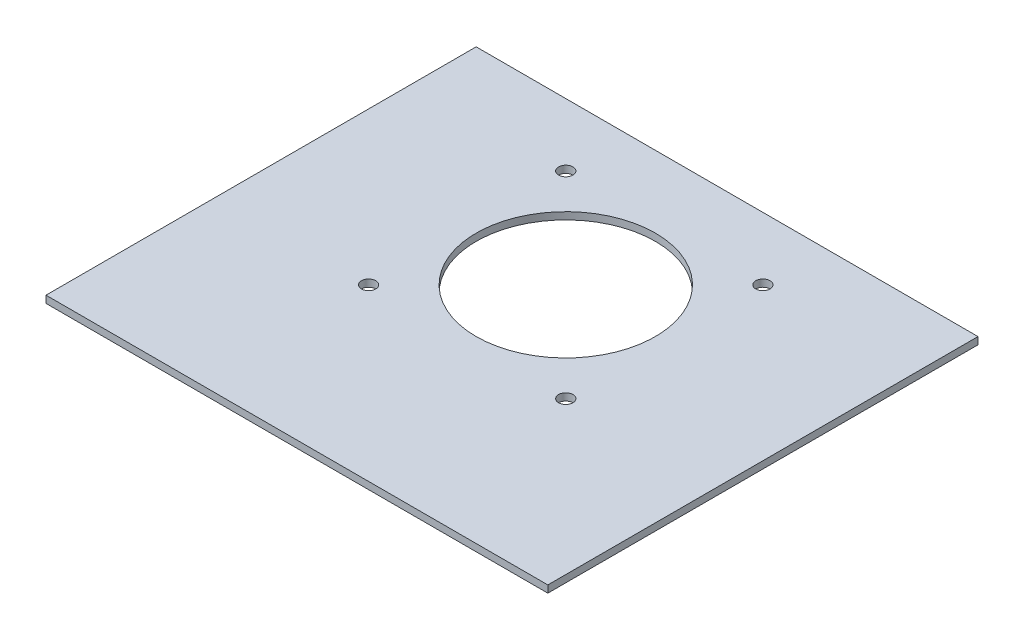
ISO-10303-21;
HEADER;
FILE_DESCRIPTION(('STEP AP214'),'2;1');
FILE_NAME('part.step','',(''),(''),'','','');
FILE_SCHEMA(('AUTOMOTIVE_DESIGN { 1 0 10303 214 1 1 1 1 }'));
ENDSEC;
DATA;
#1=APPLICATION_CONTEXT('core data for automotive mechanical design processes');
#2=APPLICATION_PROTOCOL_DEFINITION('international standard','automotive_design',2000,#1);
#3=PRODUCT_CONTEXT('',#1,'mechanical');
#4=PRODUCT('Part','Part','',(#3));
#5=PRODUCT_RELATED_PRODUCT_CATEGORY('part','',(#4));
#6=PRODUCT_DEFINITION_FORMATION('','',#4);
#7=PRODUCT_DEFINITION_CONTEXT('part definition',#1,'design');
#8=PRODUCT_DEFINITION('design','',#6,#7);
#9=PRODUCT_DEFINITION_SHAPE('','',#8);
#10=(LENGTH_UNIT() NAMED_UNIT(*) SI_UNIT(.MILLI.,.METRE.));
#11=(NAMED_UNIT(*) PLANE_ANGLE_UNIT() SI_UNIT($,.RADIAN.));
#12=(NAMED_UNIT(*) SI_UNIT($,.STERADIAN.) SOLID_ANGLE_UNIT());
#13=UNCERTAINTY_MEASURE_WITH_UNIT(LENGTH_MEASURE(1.E-05),#10,'distance_accuracy_value','');
#14=(GEOMETRIC_REPRESENTATION_CONTEXT(3) GLOBAL_UNCERTAINTY_ASSIGNED_CONTEXT((#13)) GLOBAL_UNIT_ASSIGNED_CONTEXT((#10,
#11,#12)) REPRESENTATION_CONTEXT('',''));
#15=CARTESIAN_POINT('',(0.,0.,0.));
#16=DIRECTION('',(0.,0.,1.));
#17=DIRECTION('',(1.,0.,0.));
#18=AXIS2_PLACEMENT_3D('',#15,#16,#17);
#19=CARTESIAN_POINT('',(0.,2.,0.));
#20=DIRECTION('',(0.,1.,0.));
#21=DIRECTION('',(0.,0.,1.));
#22=AXIS2_PLACEMENT_3D('',#19,#20,#21);
#23=PLANE('',#22);
#24=CARTESIAN_POINT('',(-27.4999999999994,2.,27.5000000000004));
#25=DIRECTION('',(0.,1.,0.));
#26=DIRECTION('',(0.,0.,1.));
#27=AXIS2_PLACEMENT_3D('',#24,#25,#26);
#28=CIRCLE('',#27,2.);
#29=CARTESIAN_POINT('',(-27.4999999999994,2.,29.5000000000004));
#30=VERTEX_POINT('',#29);
#31=EDGE_CURVE('E128',#30,#30,#28,.T.);
#32=ORIENTED_EDGE('',*,*,#31,.F.);
#33=EDGE_LOOP('',(#32));
#34=FACE_BOUND('',#33,.T.);
#35=CARTESIAN_POINT('',(0.,2.,0.));
#36=DIRECTION('',(0.,1.,0.));
#37=DIRECTION('',(0.,0.,1.));
#38=AXIS2_PLACEMENT_3D('',#35,#36,#37);
#39=CIRCLE('',#38,25.);
#40=CARTESIAN_POINT('',(0.,2.,25.));
#41=VERTEX_POINT('',#40);
#42=EDGE_CURVE('E116',#41,#41,#39,.T.);
#43=ORIENTED_EDGE('',*,*,#42,.F.);
#44=EDGE_LOOP('',(#43));
#45=FACE_BOUND('',#44,.T.);
#46=DIRECTION('',(0.,0.,1.));
#47=VECTOR('',#46,1.);
#48=CARTESIAN_POINT('',(-70.,2.,-45.));
#49=LINE('',#48,#47);
#50=CARTESIAN_POINT('',(-70.,2.,-45.));
#51=VERTEX_POINT('',#50);
#52=CARTESIAN_POINT('',(-70.,2.,75.));
#53=VERTEX_POINT('',#52);
#54=EDGE_CURVE('E86',#51,#53,#49,.T.);
#55=ORIENTED_EDGE('',*,*,#54,.T.);
#56=DIRECTION('',(1.,0.,0.));
#57=VECTOR('',#56,1.);
#58=CARTESIAN_POINT('',(-70.,2.,75.));
#59=LINE('',#58,#57);
#60=CARTESIAN_POINT('',(70.,2.,75.));
#61=VERTEX_POINT('',#60);
#62=EDGE_CURVE('E81',#53,#61,#59,.T.);
#63=ORIENTED_EDGE('',*,*,#62,.T.);
#64=DIRECTION('',(0.,0.,-1.));
#65=VECTOR('',#64,1.);
#66=CARTESIAN_POINT('',(70.,2.,-45.));
#67=LINE('',#66,#65);
#68=CARTESIAN_POINT('',(70.,2.,-45.));
#69=VERTEX_POINT('',#68);
#70=EDGE_CURVE('E84',#61,#69,#67,.T.);
#71=ORIENTED_EDGE('',*,*,#70,.T.);
#72=DIRECTION('',(-1.,0.,0.));
#73=VECTOR('',#72,1.);
#74=CARTESIAN_POINT('',(-70.,2.,-45.));
#75=LINE('',#74,#73);
#76=EDGE_CURVE('E51',#69,#51,#75,.T.);
#77=ORIENTED_EDGE('',*,*,#76,.T.);
#78=EDGE_LOOP('',(#55,#63,#71,#77));
#79=FACE_BOUND('',#78,.T.);
#80=CARTESIAN_POINT('',(27.5,2.,-27.5));
#81=DIRECTION('',(0.,1.,0.));
#82=DIRECTION('',(0.,0.,1.));
#83=AXIS2_PLACEMENT_3D('',#80,#81,#82);
#84=CIRCLE('',#83,2.);
#85=CARTESIAN_POINT('',(27.5,2.,-25.5));
#86=VERTEX_POINT('',#85);
#87=EDGE_CURVE('E101',#86,#86,#84,.T.);
#88=ORIENTED_EDGE('',*,*,#87,.F.);
#89=EDGE_LOOP('',(#88));
#90=FACE_BOUND('',#89,.T.);
#91=CARTESIAN_POINT('',(-27.5,2.,-27.4999999999996));
#92=DIRECTION('',(0.,1.,0.));
#93=DIRECTION('',(0.,0.,1.));
#94=AXIS2_PLACEMENT_3D('',#91,#92,#93);
#95=CIRCLE('',#94,2.);
#96=CARTESIAN_POINT('',(-27.5,2.,-25.4999999999996));
#97=VERTEX_POINT('',#96);
#98=EDGE_CURVE('E122',#97,#97,#95,.T.);
#99=ORIENTED_EDGE('',*,*,#98,.F.);
#100=EDGE_LOOP('',(#99));
#101=FACE_BOUND('',#100,.T.);
#102=CARTESIAN_POINT('',(27.5000000000006,2.,27.5));
#103=DIRECTION('',(0.,1.,0.));
#104=DIRECTION('',(0.,0.,1.));
#105=AXIS2_PLACEMENT_3D('',#102,#103,#104);
#106=CIRCLE('',#105,2.);
#107=CARTESIAN_POINT('',(27.5000000000006,2.,29.5));
#108=VERTEX_POINT('',#107);
#109=EDGE_CURVE('E134',#108,#108,#106,.T.);
#110=ORIENTED_EDGE('',*,*,#109,.F.);
#111=EDGE_LOOP('',(#110));
#112=FACE_BOUND('',#111,.T.);
#113=ADVANCED_FACE('F34',(#34,#45,#79,#90,#101,#112),#23,.T.);
#114=CARTESIAN_POINT('',(0.,0.,0.));
#115=DIRECTION('',(0.,1.,0.));
#116=DIRECTION('',(0.,0.,1.));
#117=AXIS2_PLACEMENT_3D('',#114,#115,#116);
#118=PLANE('',#117);
#119=DIRECTION('',(0.,0.,1.));
#120=VECTOR('',#119,1.);
#121=CARTESIAN_POINT('',(-70.,0.,-45.));
#122=LINE('',#121,#120);
#123=CARTESIAN_POINT('',(-70.,0.,-45.));
#124=VERTEX_POINT('',#123);
#125=CARTESIAN_POINT('',(-70.,0.,75.));
#126=VERTEX_POINT('',#125);
#127=EDGE_CURVE('E98',#124,#126,#122,.T.);
#128=ORIENTED_EDGE('',*,*,#127,.F.);
#129=DIRECTION('',(-1.,0.,0.));
#130=VECTOR('',#129,1.);
#131=CARTESIAN_POINT('',(-70.,0.,-45.));
#132=LINE('',#131,#130);
#133=CARTESIAN_POINT('',(70.,0.,-45.));
#134=VERTEX_POINT('',#133);
#135=EDGE_CURVE('E74',#134,#124,#132,.T.);
#136=ORIENTED_EDGE('',*,*,#135,.F.);
#137=DIRECTION('',(0.,0.,-1.));
#138=VECTOR('',#137,1.);
#139=CARTESIAN_POINT('',(70.,0.,-45.));
#140=LINE('',#139,#138);
#141=CARTESIAN_POINT('',(70.,0.,75.));
#142=VERTEX_POINT('',#141);
#143=EDGE_CURVE('E68',#142,#134,#140,.T.);
#144=ORIENTED_EDGE('',*,*,#143,.F.);
#145=DIRECTION('',(1.,0.,0.));
#146=VECTOR('',#145,1.);
#147=CARTESIAN_POINT('',(-70.,0.,75.));
#148=LINE('',#147,#146);
#149=EDGE_CURVE('E90',#126,#142,#148,.T.);
#150=ORIENTED_EDGE('',*,*,#149,.F.);
#151=EDGE_LOOP('',(#128,#136,#144,#150));
#152=FACE_BOUND('',#151,.T.);
#153=CARTESIAN_POINT('',(27.5,0.,-27.5));
#154=DIRECTION('',(0.,1.,0.));
#155=DIRECTION('',(0.,0.,1.));
#156=AXIS2_PLACEMENT_3D('',#153,#154,#155);
#157=CIRCLE('',#156,2.);
#158=CARTESIAN_POINT('',(27.5,0.,-25.5));
#159=VERTEX_POINT('',#158);
#160=EDGE_CURVE('E113',#159,#159,#157,.T.);
#161=ORIENTED_EDGE('',*,*,#160,.T.);
#162=EDGE_LOOP('',(#161));
#163=FACE_BOUND('',#162,.T.);
#164=CARTESIAN_POINT('',(0.,0.,0.));
#165=DIRECTION('',(0.,1.,0.));
#166=DIRECTION('',(0.,0.,1.));
#167=AXIS2_PLACEMENT_3D('',#164,#165,#166);
#168=CIRCLE('',#167,25.);
#169=CARTESIAN_POINT('',(0.,0.,25.));
#170=VERTEX_POINT('',#169);
#171=EDGE_CURVE('E119',#170,#170,#168,.T.);
#172=ORIENTED_EDGE('',*,*,#171,.T.);
#173=EDGE_LOOP('',(#172));
#174=FACE_BOUND('',#173,.T.);
#175=CARTESIAN_POINT('',(-27.5,0.,-27.4999999999996));
#176=DIRECTION('',(0.,1.,0.));
#177=DIRECTION('',(0.,0.,1.));
#178=AXIS2_PLACEMENT_3D('',#175,#176,#177);
#179=CIRCLE('',#178,2.);
#180=CARTESIAN_POINT('',(-27.5,0.,-25.4999999999996));
#181=VERTEX_POINT('',#180);
#182=EDGE_CURVE('E125',#181,#181,#179,.T.);
#183=ORIENTED_EDGE('',*,*,#182,.T.);
#184=EDGE_LOOP('',(#183));
#185=FACE_BOUND('',#184,.T.);
#186=CARTESIAN_POINT('',(-27.4999999999994,0.,27.5000000000004));
#187=DIRECTION('',(0.,1.,0.));
#188=DIRECTION('',(0.,0.,1.));
#189=AXIS2_PLACEMENT_3D('',#186,#187,#188);
#190=CIRCLE('',#189,2.);
#191=CARTESIAN_POINT('',(-27.4999999999994,0.,29.5000000000004));
#192=VERTEX_POINT('',#191);
#193=EDGE_CURVE('E131',#192,#192,#190,.T.);
#194=ORIENTED_EDGE('',*,*,#193,.T.);
#195=EDGE_LOOP('',(#194));
#196=FACE_BOUND('',#195,.T.);
#197=CARTESIAN_POINT('',(27.5000000000006,0.,27.5));
#198=DIRECTION('',(0.,1.,0.));
#199=DIRECTION('',(0.,0.,1.));
#200=AXIS2_PLACEMENT_3D('',#197,#198,#199);
#201=CIRCLE('',#200,2.);
#202=CARTESIAN_POINT('',(27.5000000000006,0.,29.5));
#203=VERTEX_POINT('',#202);
#204=EDGE_CURVE('E137',#203,#203,#201,.T.);
#205=ORIENTED_EDGE('',*,*,#204,.T.);
#206=EDGE_LOOP('',(#205));
#207=FACE_BOUND('',#206,.T.);
#208=ADVANCED_FACE('F109',(#152,#163,#174,#185,#196,#207),#118,.F.);
#209=CARTESIAN_POINT('',(-70.,2.,-45.));
#210=DIRECTION('',(1.,0.,0.));
#211=DIRECTION('',(0.,0.,-1.));
#212=AXIS2_PLACEMENT_3D('',#209,#210,#211);
#213=PLANE('',#212);
#214=ORIENTED_EDGE('',*,*,#127,.T.);
#215=DIRECTION('',(0.,-1.,0.));
#216=VECTOR('',#215,1.);
#217=CARTESIAN_POINT('',(-70.,2.,75.));
#218=LINE('',#217,#216);
#219=EDGE_CURVE('E11',#53,#126,#218,.T.);
#220=ORIENTED_EDGE('',*,*,#219,.F.);
#221=ORIENTED_EDGE('',*,*,#54,.F.);
#222=DIRECTION('',(0.,-1.,0.));
#223=VECTOR('',#222,1.);
#224=CARTESIAN_POINT('',(-70.,2.,-45.));
#225=LINE('',#224,#223);
#226=EDGE_CURVE('E94',#51,#124,#225,.T.);
#227=ORIENTED_EDGE('',*,*,#226,.T.);
#228=EDGE_LOOP('',(#214,#220,#221,#227));
#229=FACE_BOUND('',#228,.T.);
#230=ADVANCED_FACE('F36',(#229),#213,.F.);
#231=CARTESIAN_POINT('',(-70.,2.,75.));
#232=DIRECTION('',(0.,0.,-1.));
#233=DIRECTION('',(-1.,0.,0.));
#234=AXIS2_PLACEMENT_3D('',#231,#232,#233);
#235=PLANE('',#234);
#236=ORIENTED_EDGE('',*,*,#149,.T.);
#237=DIRECTION('',(0.,-1.,0.));
#238=VECTOR('',#237,1.);
#239=CARTESIAN_POINT('',(70.,2.,75.));
#240=LINE('',#239,#238);
#241=EDGE_CURVE('E43',#61,#142,#240,.T.);
#242=ORIENTED_EDGE('',*,*,#241,.F.);
#243=ORIENTED_EDGE('',*,*,#62,.F.);
#244=ORIENTED_EDGE('',*,*,#219,.T.);
#245=EDGE_LOOP('',(#236,#242,#243,#244));
#246=FACE_BOUND('',#245,.T.);
#247=ADVANCED_FACE('F89',(#246),#235,.F.);
#248=CARTESIAN_POINT('',(70.,2.,-45.));
#249=DIRECTION('',(-1.,0.,0.));
#250=DIRECTION('',(0.,0.,1.));
#251=AXIS2_PLACEMENT_3D('',#248,#249,#250);
#252=PLANE('',#251);
#253=ORIENTED_EDGE('',*,*,#143,.T.);
#254=DIRECTION('',(0.,-1.,0.));
#255=VECTOR('',#254,1.);
#256=CARTESIAN_POINT('',(70.,2.,-45.));
#257=LINE('',#256,#255);
#258=EDGE_CURVE('E91',#69,#134,#257,.T.);
#259=ORIENTED_EDGE('',*,*,#258,.F.);
#260=ORIENTED_EDGE('',*,*,#70,.F.);
#261=ORIENTED_EDGE('',*,*,#241,.T.);
#262=EDGE_LOOP('',(#253,#259,#260,#261));
#263=FACE_BOUND('',#262,.T.);
#264=ADVANCED_FACE('F92',(#263),#252,.F.);
#265=CARTESIAN_POINT('',(-70.,2.,-45.));
#266=DIRECTION('',(0.,0.,1.));
#267=DIRECTION('',(1.,0.,0.));
#268=AXIS2_PLACEMENT_3D('',#265,#266,#267);
#269=PLANE('',#268);
#270=ORIENTED_EDGE('',*,*,#135,.T.);
#271=ORIENTED_EDGE('',*,*,#226,.F.);
#272=ORIENTED_EDGE('',*,*,#76,.F.);
#273=ORIENTED_EDGE('',*,*,#258,.T.);
#274=EDGE_LOOP('',(#270,#271,#272,#273));
#275=FACE_BOUND('',#274,.T.);
#276=ADVANCED_FACE('F106',(#275),#269,.F.);
#277=CARTESIAN_POINT('',(27.5,2.,-27.5));
#278=DIRECTION('',(0.,-1.,0.));
#279=DIRECTION('',(0.,0.,-1.));
#280=AXIS2_PLACEMENT_3D('',#277,#278,#279);
#281=CYLINDRICAL_SURFACE('',#280,2.);
#282=ORIENTED_EDGE('',*,*,#87,.T.);
#283=EDGE_LOOP('',(#282));
#284=FACE_BOUND('',#283,.T.);
#285=ORIENTED_EDGE('',*,*,#160,.F.);
#286=EDGE_LOOP('',(#285));
#287=FACE_BOUND('',#286,.T.);
#288=ADVANCED_FACE('F156',(#284,#287),#281,.F.);
#289=CARTESIAN_POINT('',(0.,2.,0.));
#290=DIRECTION('',(0.,-1.,0.));
#291=DIRECTION('',(0.,0.,-1.));
#292=AXIS2_PLACEMENT_3D('',#289,#290,#291);
#293=CYLINDRICAL_SURFACE('',#292,25.);
#294=ORIENTED_EDGE('',*,*,#42,.T.);
#295=EDGE_LOOP('',(#294));
#296=FACE_BOUND('',#295,.T.);
#297=ORIENTED_EDGE('',*,*,#171,.F.);
#298=EDGE_LOOP('',(#297));
#299=FACE_BOUND('',#298,.T.);
#300=ADVANCED_FACE('F202',(#296,#299),#293,.F.);
#301=CARTESIAN_POINT('',(-27.5,2.,-27.4999999999996));
#302=DIRECTION('',(0.,-1.,0.));
#303=DIRECTION('',(0.,0.,-1.));
#304=AXIS2_PLACEMENT_3D('',#301,#302,#303);
#305=CYLINDRICAL_SURFACE('',#304,2.);
#306=ORIENTED_EDGE('',*,*,#98,.T.);
#307=EDGE_LOOP('',(#306));
#308=FACE_BOUND('',#307,.T.);
#309=ORIENTED_EDGE('',*,*,#182,.F.);
#310=EDGE_LOOP('',(#309));
#311=FACE_BOUND('',#310,.T.);
#312=ADVANCED_FACE('F210',(#308,#311),#305,.F.);
#313=CARTESIAN_POINT('',(-27.4999999999994,2.,27.5000000000004));
#314=DIRECTION('',(0.,-1.,0.));
#315=DIRECTION('',(0.,0.,-1.));
#316=AXIS2_PLACEMENT_3D('',#313,#314,#315);
#317=CYLINDRICAL_SURFACE('',#316,2.);
#318=ORIENTED_EDGE('',*,*,#31,.T.);
#319=EDGE_LOOP('',(#318));
#320=FACE_BOUND('',#319,.T.);
#321=ORIENTED_EDGE('',*,*,#193,.F.);
#322=EDGE_LOOP('',(#321));
#323=FACE_BOUND('',#322,.T.);
#324=ADVANCED_FACE('F218',(#320,#323),#317,.F.);
#325=CARTESIAN_POINT('',(27.5000000000006,2.,27.5));
#326=DIRECTION('',(0.,-1.,0.));
#327=DIRECTION('',(0.,0.,-1.));
#328=AXIS2_PLACEMENT_3D('',#325,#326,#327);
#329=CYLINDRICAL_SURFACE('',#328,2.);
#330=ORIENTED_EDGE('',*,*,#109,.T.);
#331=EDGE_LOOP('',(#330));
#332=FACE_BOUND('',#331,.T.);
#333=ORIENTED_EDGE('',*,*,#204,.F.);
#334=EDGE_LOOP('',(#333));
#335=FACE_BOUND('',#334,.T.);
#336=ADVANCED_FACE('F143',(#332,#335),#329,.F.);
#337=CLOSED_SHELL('',(#113,#208,#230,#247,#264,#276,#288,#300,#312,#324,#336));
#338=MANIFOLD_SOLID_BREP('B2',#337);
#339=ADVANCED_BREP_SHAPE_REPRESENTATION('',(#18,#338),#14);
#340=SHAPE_DEFINITION_REPRESENTATION(#9,#339);
ENDSEC;
END-ISO-10303-21;
